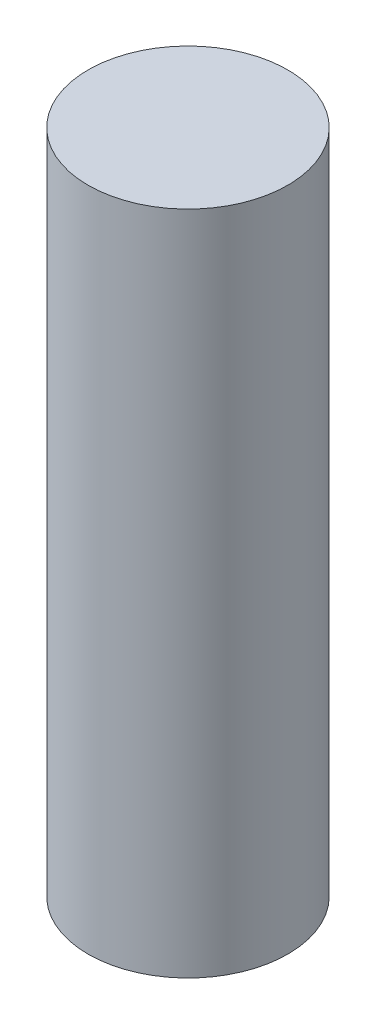
ISO-10303-21;
HEADER;
FILE_DESCRIPTION(('STEP AP214'),'2;1');
FILE_NAME('part.step','',(''),(''),'','','');
FILE_SCHEMA(('AUTOMOTIVE_DESIGN { 1 0 10303 214 1 1 1 1 }'));
ENDSEC;
DATA;
#1=APPLICATION_CONTEXT('core data for automotive mechanical design processes');
#2=APPLICATION_PROTOCOL_DEFINITION('international standard','automotive_design',2000,#1);
#3=PRODUCT_CONTEXT('',#1,'mechanical');
#4=PRODUCT('Part','Part','',(#3));
#5=PRODUCT_RELATED_PRODUCT_CATEGORY('part','',(#4));
#6=PRODUCT_DEFINITION_FORMATION('','',#4);
#7=PRODUCT_DEFINITION_CONTEXT('part definition',#1,'design');
#8=PRODUCT_DEFINITION('design','',#6,#7);
#9=PRODUCT_DEFINITION_SHAPE('','',#8);
#10=(LENGTH_UNIT() NAMED_UNIT(*) SI_UNIT(.MILLI.,.METRE.));
#11=(NAMED_UNIT(*) PLANE_ANGLE_UNIT() SI_UNIT($,.RADIAN.));
#12=(NAMED_UNIT(*) SI_UNIT($,.STERADIAN.) SOLID_ANGLE_UNIT());
#13=UNCERTAINTY_MEASURE_WITH_UNIT(LENGTH_MEASURE(1.E-05),#10,'distance_accuracy_value','');
#14=(GEOMETRIC_REPRESENTATION_CONTEXT(3) GLOBAL_UNCERTAINTY_ASSIGNED_CONTEXT((#13)) GLOBAL_UNIT_ASSIGNED_CONTEXT((#10,
#11,#12)) REPRESENTATION_CONTEXT('',''));
#15=CARTESIAN_POINT('',(0.,0.,0.));
#16=DIRECTION('',(0.,0.,1.));
#17=DIRECTION('',(1.,0.,0.));
#18=AXIS2_PLACEMENT_3D('',#15,#16,#17);
#19=CARTESIAN_POINT('',(0.,63.5,0.));
#20=DIRECTION('',(0.,-1.,0.));
#21=DIRECTION('',(0.,0.,-1.));
#22=AXIS2_PLACEMENT_3D('',#19,#20,#21);
#23=CYLINDRICAL_SURFACE('',#22,9.525);
#24=CARTESIAN_POINT('',(0.,63.5,0.));
#25=DIRECTION('',(0.,1.,0.));
#26=DIRECTION('',(0.,0.,1.));
#27=AXIS2_PLACEMENT_3D('',#24,#25,#26);
#28=CIRCLE('',#27,9.525);
#29=CARTESIAN_POINT('',(0.,63.5,9.525));
#30=VERTEX_POINT('',#29);
#31=EDGE_CURVE('E10',#30,#30,#28,.T.);
#32=ORIENTED_EDGE('',*,*,#31,.F.);
#33=EDGE_LOOP('',(#32));
#34=FACE_BOUND('',#33,.T.);
#35=CARTESIAN_POINT('',(0.,0.,0.));
#36=DIRECTION('',(0.,1.,0.));
#37=DIRECTION('',(0.,0.,1.));
#38=AXIS2_PLACEMENT_3D('',#35,#36,#37);
#39=CIRCLE('',#38,9.525);
#40=CARTESIAN_POINT('',(0.,0.,9.525));
#41=VERTEX_POINT('',#40);
#42=EDGE_CURVE('E18',#41,#41,#39,.T.);
#43=ORIENTED_EDGE('',*,*,#42,.T.);
#44=EDGE_LOOP('',(#43));
#45=FACE_BOUND('',#44,.T.);
#46=ADVANCED_FACE('F15',(#34,#45),#23,.T.);
#47=CARTESIAN_POINT('',(0.,63.5,0.));
#48=DIRECTION('',(0.,1.,0.));
#49=DIRECTION('',(0.,0.,1.));
#50=AXIS2_PLACEMENT_3D('',#47,#48,#49);
#51=PLANE('',#50);
#52=ORIENTED_EDGE('',*,*,#31,.T.);
#53=EDGE_LOOP('',(#52));
#54=FACE_BOUND('',#53,.T.);
#55=ADVANCED_FACE('F30',(#54),#51,.T.);
#56=CARTESIAN_POINT('',(0.,0.,0.));
#57=DIRECTION('',(0.,1.,0.));
#58=DIRECTION('',(0.,0.,1.));
#59=AXIS2_PLACEMENT_3D('',#56,#57,#58);
#60=PLANE('',#59);
#61=ORIENTED_EDGE('',*,*,#42,.F.);
#62=EDGE_LOOP('',(#61));
#63=FACE_BOUND('',#62,.T.);
#64=ADVANCED_FACE('F28',(#63),#60,.F.);
#65=CLOSED_SHELL('',(#46,#55,#64));
#66=MANIFOLD_SOLID_BREP('B1',#65);
#67=ADVANCED_BREP_SHAPE_REPRESENTATION('',(#18,#66),#14);
#68=SHAPE_DEFINITION_REPRESENTATION(#9,#67);
ENDSEC;
END-ISO-10303-21;
